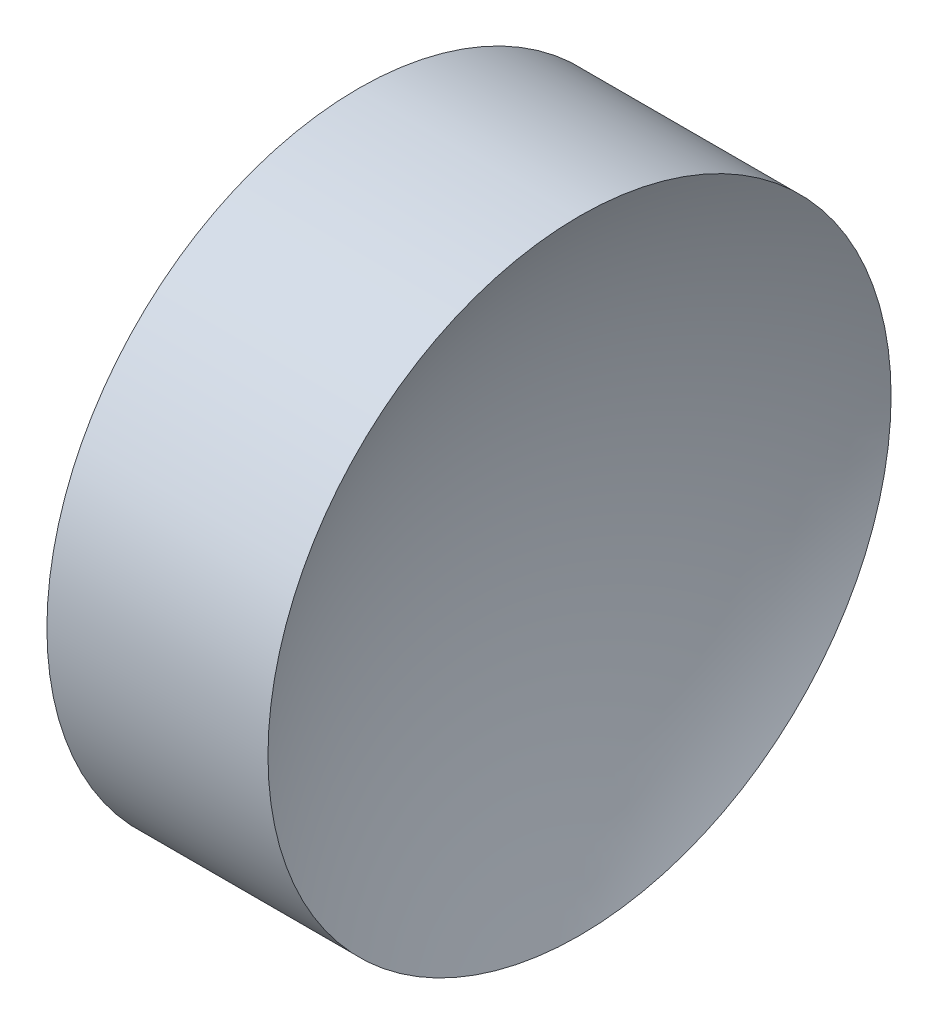
ISO-10303-21;
HEADER;
FILE_DESCRIPTION(('STEP AP214'),'2;1');
FILE_NAME('part.step','',(''),(''),'','','');
FILE_SCHEMA(('AUTOMOTIVE_DESIGN { 1 0 10303 214 1 1 1 1 }'));
ENDSEC;
DATA;
#1=APPLICATION_CONTEXT('core data for automotive mechanical design processes');
#2=APPLICATION_PROTOCOL_DEFINITION('international standard','automotive_design',2000,#1);
#3=PRODUCT_CONTEXT('',#1,'mechanical');
#4=PRODUCT('Part','Part','',(#3));
#5=PRODUCT_RELATED_PRODUCT_CATEGORY('part','',(#4));
#6=PRODUCT_DEFINITION_FORMATION('','',#4);
#7=PRODUCT_DEFINITION_CONTEXT('part definition',#1,'design');
#8=PRODUCT_DEFINITION('design','',#6,#7);
#9=PRODUCT_DEFINITION_SHAPE('','',#8);
#10=(LENGTH_UNIT() NAMED_UNIT(*) SI_UNIT(.MILLI.,.METRE.));
#11=(NAMED_UNIT(*) PLANE_ANGLE_UNIT() SI_UNIT($,.RADIAN.));
#12=(NAMED_UNIT(*) SI_UNIT($,.STERADIAN.) SOLID_ANGLE_UNIT());
#13=UNCERTAINTY_MEASURE_WITH_UNIT(LENGTH_MEASURE(1.E-05),#10,'distance_accuracy_value','');
#14=(GEOMETRIC_REPRESENTATION_CONTEXT(3) GLOBAL_UNCERTAINTY_ASSIGNED_CONTEXT((#13)) GLOBAL_UNIT_ASSIGNED_CONTEXT((#10,
#11,#12)) REPRESENTATION_CONTEXT('',''));
#15=CARTESIAN_POINT('',(0.,0.,0.));
#16=DIRECTION('',(0.,0.,1.));
#17=DIRECTION('',(1.,0.,0.));
#18=AXIS2_PLACEMENT_3D('',#15,#16,#17);
#19=CARTESIAN_POINT('',(68.44044396836,52.1780822983899,0.));
#20=DIRECTION('',(-1.,0.,0.));
#21=DIRECTION('',(0.,1.,0.));
#22=AXIS2_PLACEMENT_3D('',#19,#20,#21);
#23=SPHERICAL_SURFACE('',#22,26.4);
#24=CARTESIAN_POINT('',(91.5849897621318,52.1780822983899,0.));
#25=DIRECTION('',(-1.,0.,0.));
#26=DIRECTION('',(0.,0.,1.));
#27=AXIS2_PLACEMENT_3D('',#24,#25,#26);
#28=CIRCLE('',#27,12.7);
#29=CARTESIAN_POINT('',(91.5849897621318,52.1780822983899,12.7));
#30=VERTEX_POINT('',#29);
#31=EDGE_CURVE('E41',#30,#30,#28,.T.);
#32=ORIENTED_EDGE('',*,*,#31,.T.);
#33=EDGE_LOOP('',(#32));
#34=FACE_BOUND('',#33,.T.);
#35=ADVANCED_FACE('F35',(#34),#23,.F.);
#36=CARTESIAN_POINT('',(123.74044396836,52.1780822983899,0.));
#37=DIRECTION('',(-1.,0.,0.));
#38=DIRECTION('',(0.,-1.,0.));
#39=AXIS2_PLACEMENT_3D('',#36,#37,#38);
#40=SPHERICAL_SURFACE('',#39,26.4);
#41=CARTESIAN_POINT('',(100.595898174588,52.1780822983899,0.));
#42=DIRECTION('',(-1.,0.,0.));
#43=DIRECTION('',(0.,0.,1.));
#44=AXIS2_PLACEMENT_3D('',#41,#42,#43);
#45=CIRCLE('',#44,12.7);
#46=CARTESIAN_POINT('',(100.595898174588,52.1780822983899,12.7));
#47=VERTEX_POINT('',#46);
#48=EDGE_CURVE('E10',#47,#47,#45,.T.);
#49=ORIENTED_EDGE('',*,*,#48,.F.);
#50=EDGE_LOOP('',(#49));
#51=FACE_BOUND('',#50,.T.);
#52=ADVANCED_FACE('F50',(#51),#40,.F.);
#53=CARTESIAN_POINT('',(84.8997222282736,52.1780822983899,0.));
#54=DIRECTION('',(-1.,0.,0.));
#55=DIRECTION('',(0.,0.,1.));
#56=AXIS2_PLACEMENT_3D('',#53,#54,#55);
#57=CYLINDRICAL_SURFACE('',#56,12.7);
#58=ORIENTED_EDGE('',*,*,#31,.F.);
#59=EDGE_LOOP('',(#58));
#60=FACE_BOUND('',#59,.T.);
#61=ORIENTED_EDGE('',*,*,#48,.T.);
#62=EDGE_LOOP('',(#61));
#63=FACE_BOUND('',#62,.T.);
#64=ADVANCED_FACE('F48',(#60,#63),#57,.T.);
#65=CLOSED_SHELL('',(#35,#52,#64));
#66=MANIFOLD_SOLID_BREP('B2',#65);
#67=ADVANCED_BREP_SHAPE_REPRESENTATION('',(#18,#66),#14);
#68=SHAPE_DEFINITION_REPRESENTATION(#9,#67);
ENDSEC;
END-ISO-10303-21;
